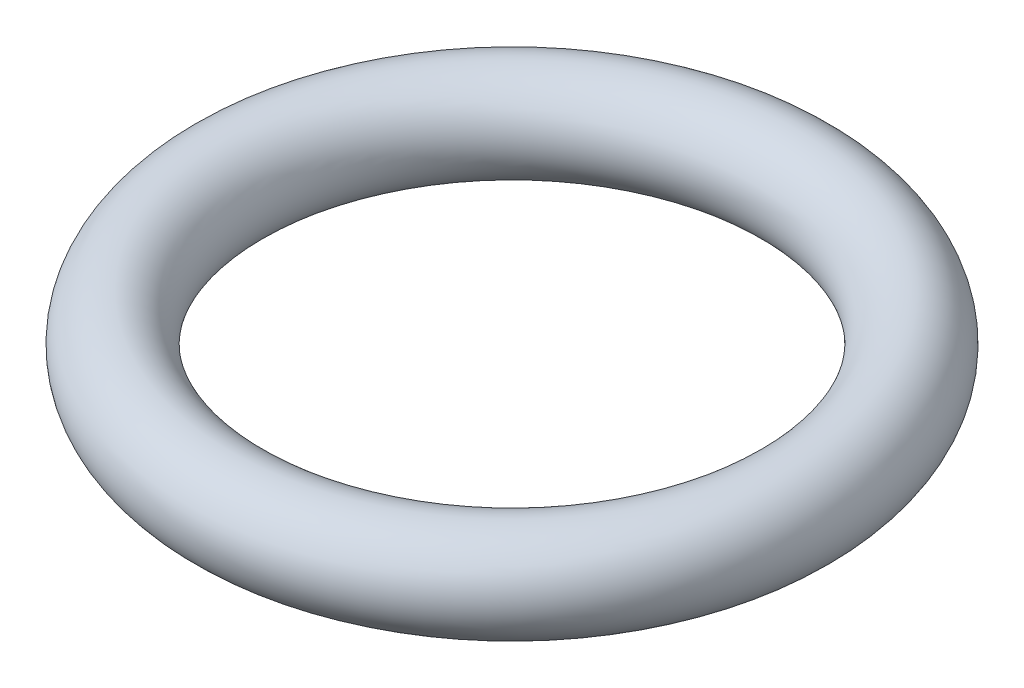
ISO-10303-21;
HEADER;
FILE_DESCRIPTION(('STEP AP214'),'2;1');
FILE_NAME('part.step','',(''),(''),'','','');
FILE_SCHEMA(('AUTOMOTIVE_DESIGN { 1 0 10303 214 1 1 1 1 }'));
ENDSEC;
DATA;
#1=APPLICATION_CONTEXT('core data for automotive mechanical design processes');
#2=APPLICATION_PROTOCOL_DEFINITION('international standard','automotive_design',2000,#1);
#3=PRODUCT_CONTEXT('',#1,'mechanical');
#4=PRODUCT('Part','Part','',(#3));
#5=PRODUCT_RELATED_PRODUCT_CATEGORY('part','',(#4));
#6=PRODUCT_DEFINITION_FORMATION('','',#4);
#7=PRODUCT_DEFINITION_CONTEXT('part definition',#1,'design');
#8=PRODUCT_DEFINITION('design','',#6,#7);
#9=PRODUCT_DEFINITION_SHAPE('','',#8);
#10=(LENGTH_UNIT() NAMED_UNIT(*) SI_UNIT(.MILLI.,.METRE.));
#11=(NAMED_UNIT(*) PLANE_ANGLE_UNIT() SI_UNIT($,.RADIAN.));
#12=(NAMED_UNIT(*) SI_UNIT($,.STERADIAN.) SOLID_ANGLE_UNIT());
#13=UNCERTAINTY_MEASURE_WITH_UNIT(LENGTH_MEASURE(1.E-05),#10,'distance_accuracy_value','');
#14=(GEOMETRIC_REPRESENTATION_CONTEXT(3) GLOBAL_UNCERTAINTY_ASSIGNED_CONTEXT((#13)) GLOBAL_UNIT_ASSIGNED_CONTEXT((#10,
#11,#12)) REPRESENTATION_CONTEXT('',''));
#15=CARTESIAN_POINT('',(0.,0.,0.));
#16=DIRECTION('',(0.,0.,1.));
#17=DIRECTION('',(1.,0.,0.));
#18=AXIS2_PLACEMENT_3D('',#15,#16,#17);
#19=CARTESIAN_POINT('',(0.,0.,0.));
#20=DIRECTION('',(0.,1.,0.));
#21=DIRECTION('',(0.,0.,1.));
#22=AXIS2_PLACEMENT_3D('',#19,#20,#21);
#23=TOROIDAL_SURFACE('',#22,152.4,25.4);
#24=CARTESIAN_POINT('',(-152.4,0.,0.));
#25=DIRECTION('',(0.,0.,1.));
#26=DIRECTION('',(1.,0.,0.));
#27=AXIS2_PLACEMENT_3D('',#24,#25,#26);
#28=CIRCLE('',#27,25.4);
#29=CARTESIAN_POINT('',(-177.8,0.,0.));
#30=VERTEX_POINT('',#29);
#31=EDGE_CURVE('E10',#30,#30,#28,.T.);
#32=CARTESIAN_POINT('',(0.,0.,0.));
#33=DIRECTION('',(0.,1.,0.));
#34=DIRECTION('',(0.,0.,1.));
#35=AXIS2_PLACEMENT_3D('',#32,#33,#34);
#36=CIRCLE('',#35,177.8);
#37=EDGE_CURVE('',#30,#30,#36,.T.);
#38=ORIENTED_EDGE('',*,*,#31,.T.);
#39=ORIENTED_EDGE('',*,*,#31,.F.);
#40=ORIENTED_EDGE('',*,*,#37,.T.);
#41=ORIENTED_EDGE('',*,*,#37,.F.);
#42=EDGE_LOOP('',(#38,#40,#39,#41));
#43=FACE_BOUND('',#42,.T.);
#44=ADVANCED_FACE('F31',(#43),#23,.T.);
#45=CLOSED_SHELL('',(#44));
#46=MANIFOLD_SOLID_BREP('B2',#45);
#47=ADVANCED_BREP_SHAPE_REPRESENTATION('',(#18,#46),#14);
#48=SHAPE_DEFINITION_REPRESENTATION(#9,#47);
ENDSEC;
END-ISO-10303-21;
